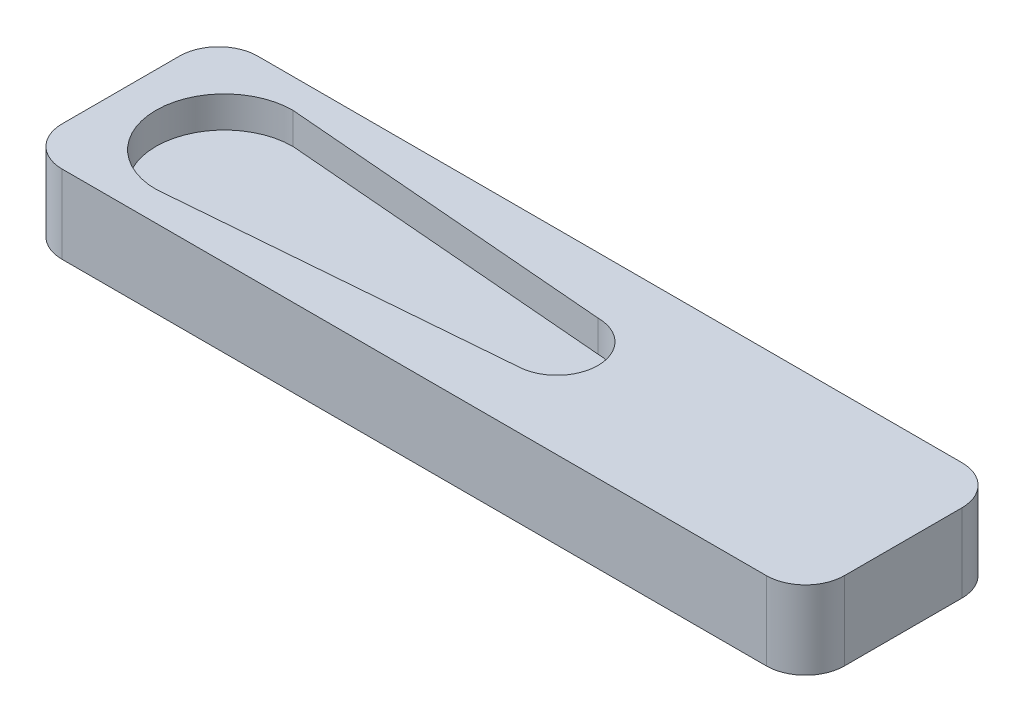
ISO-10303-21;
HEADER;
FILE_DESCRIPTION(('STEP AP214'),'2;1');
FILE_NAME('part.step','',(''),(''),'','','');
FILE_SCHEMA(('AUTOMOTIVE_DESIGN { 1 0 10303 214 1 1 1 1 }'));
ENDSEC;
DATA;
#1=APPLICATION_CONTEXT('core data for automotive mechanical design processes');
#2=APPLICATION_PROTOCOL_DEFINITION('international standard','automotive_design',2000,#1);
#3=PRODUCT_CONTEXT('',#1,'mechanical');
#4=PRODUCT('Part','Part','',(#3));
#5=PRODUCT_RELATED_PRODUCT_CATEGORY('part','',(#4));
#6=PRODUCT_DEFINITION_FORMATION('','',#4);
#7=PRODUCT_DEFINITION_CONTEXT('part definition',#1,'design');
#8=PRODUCT_DEFINITION('design','',#6,#7);
#9=PRODUCT_DEFINITION_SHAPE('','',#8);
#10=(LENGTH_UNIT() NAMED_UNIT(*) SI_UNIT(.MILLI.,.METRE.));
#11=(NAMED_UNIT(*) PLANE_ANGLE_UNIT() SI_UNIT($,.RADIAN.));
#12=(NAMED_UNIT(*) SI_UNIT($,.STERADIAN.) SOLID_ANGLE_UNIT());
#13=UNCERTAINTY_MEASURE_WITH_UNIT(LENGTH_MEASURE(1.E-05),#10,'distance_accuracy_value','');
#14=(GEOMETRIC_REPRESENTATION_CONTEXT(3) GLOBAL_UNCERTAINTY_ASSIGNED_CONTEXT((#13)) GLOBAL_UNIT_ASSIGNED_CONTEXT((#10,
#11,#12)) REPRESENTATION_CONTEXT('',''));
#15=CARTESIAN_POINT('',(0.,0.,0.));
#16=DIRECTION('',(0.,0.,1.));
#17=DIRECTION('',(1.,0.,0.));
#18=AXIS2_PLACEMENT_3D('',#15,#16,#17);
#19=CARTESIAN_POINT('',(20.,4.,5.));
#20=DIRECTION('',(-1.,0.,0.));
#21=DIRECTION('',(0.,0.,1.));
#22=AXIS2_PLACEMENT_3D('',#19,#20,#21);
#23=PLANE('',#22);
#24=DIRECTION('',(0.,0.,-1.));
#25=VECTOR('',#24,1.);
#26=CARTESIAN_POINT('',(20.,4.,5.));
#27=LINE('',#26,#25);
#28=CARTESIAN_POINT('',(20.,4.,3.));
#29=VERTEX_POINT('',#28);
#30=CARTESIAN_POINT('',(20.,4.,-3.));
#31=VERTEX_POINT('',#30);
#32=EDGE_CURVE('E190',#29,#31,#27,.T.);
#33=ORIENTED_EDGE('',*,*,#32,.F.);
#34=DIRECTION('',(0.,-1.,0.));
#35=VECTOR('',#34,1.);
#36=CARTESIAN_POINT('',(20.,4.,3.));
#37=LINE('',#36,#35);
#38=CARTESIAN_POINT('',(20.,0.,3.));
#39=VERTEX_POINT('',#38);
#40=EDGE_CURVE('E221',#29,#39,#37,.T.);
#41=ORIENTED_EDGE('',*,*,#40,.T.);
#42=DIRECTION('',(0.,0.,-1.));
#43=VECTOR('',#42,1.);
#44=CARTESIAN_POINT('',(20.,0.,5.));
#45=LINE('',#44,#43);
#46=CARTESIAN_POINT('',(20.,0.,-3.));
#47=VERTEX_POINT('',#46);
#48=EDGE_CURVE('E184',#39,#47,#45,.T.);
#49=ORIENTED_EDGE('',*,*,#48,.T.);
#50=DIRECTION('',(0.,-1.,0.));
#51=VECTOR('',#50,1.);
#52=CARTESIAN_POINT('',(20.,4.,-3.));
#53=LINE('',#52,#51);
#54=EDGE_CURVE('E205',#47,#31,#53,.F.);
#55=ORIENTED_EDGE('',*,*,#54,.T.);
#56=EDGE_LOOP('',(#33,#41,#49,#55));
#57=FACE_BOUND('',#56,.T.);
#58=ADVANCED_FACE('F45',(#57),#23,.F.);
#59=CARTESIAN_POINT('',(-20.,4.,-5.));
#60=DIRECTION('',(0.,0.,1.));
#61=DIRECTION('',(1.,0.,0.));
#62=AXIS2_PLACEMENT_3D('',#59,#60,#61);
#63=PLANE('',#62);
#64=DIRECTION('',(-1.,0.,0.));
#65=VECTOR('',#64,1.);
#66=CARTESIAN_POINT('',(-20.,4.,-5.));
#67=LINE('',#66,#65);
#68=CARTESIAN_POINT('',(18.,4.,-5.));
#69=VERTEX_POINT('',#68);
#70=CARTESIAN_POINT('',(-18.,4.,-5.));
#71=VERTEX_POINT('',#70);
#72=EDGE_CURVE('E194',#69,#71,#67,.T.);
#73=ORIENTED_EDGE('',*,*,#72,.F.);
#74=DIRECTION('',(0.,-1.,0.));
#75=VECTOR('',#74,1.);
#76=CARTESIAN_POINT('',(18.,4.,-5.));
#77=LINE('',#76,#75);
#78=CARTESIAN_POINT('',(18.,0.,-5.));
#79=VERTEX_POINT('',#78);
#80=EDGE_CURVE('E258',#69,#79,#77,.T.);
#81=ORIENTED_EDGE('',*,*,#80,.T.);
#82=DIRECTION('',(-1.,0.,0.));
#83=VECTOR('',#82,1.);
#84=CARTESIAN_POINT('',(-20.,0.,-5.));
#85=LINE('',#84,#83);
#86=CARTESIAN_POINT('',(-18.,0.,-5.));
#87=VERTEX_POINT('',#86);
#88=EDGE_CURVE('E209',#79,#87,#85,.T.);
#89=ORIENTED_EDGE('',*,*,#88,.T.);
#90=DIRECTION('',(0.,-1.,0.));
#91=VECTOR('',#90,1.);
#92=CARTESIAN_POINT('',(-18.,4.,-5.));
#93=LINE('',#92,#91);
#94=EDGE_CURVE('E255',#87,#71,#93,.F.);
#95=ORIENTED_EDGE('',*,*,#94,.T.);
#96=EDGE_LOOP('',(#73,#81,#89,#95));
#97=FACE_BOUND('',#96,.T.);
#98=ADVANCED_FACE('F294',(#97),#63,.F.);
#99=CARTESIAN_POINT('',(-20.,4.,5.));
#100=DIRECTION('',(1.,0.,0.));
#101=DIRECTION('',(0.,0.,-1.));
#102=AXIS2_PLACEMENT_3D('',#99,#100,#101);
#103=PLANE('',#102);
#104=DIRECTION('',(0.,0.,1.));
#105=VECTOR('',#104,1.);
#106=CARTESIAN_POINT('',(-20.,0.,5.));
#107=LINE('',#106,#105);
#108=CARTESIAN_POINT('',(-20.,0.,-3.));
#109=VERTEX_POINT('',#108);
#110=CARTESIAN_POINT('',(-20.,0.,3.));
#111=VERTEX_POINT('',#110);
#112=EDGE_CURVE('E213',#109,#111,#107,.T.);
#113=ORIENTED_EDGE('',*,*,#112,.T.);
#114=DIRECTION('',(0.,-1.,0.));
#115=VECTOR('',#114,1.);
#116=CARTESIAN_POINT('',(-20.,4.,3.));
#117=LINE('',#116,#115);
#118=CARTESIAN_POINT('',(-20.,4.,3.));
#119=VERTEX_POINT('',#118);
#120=EDGE_CURVE('E11',#111,#119,#117,.F.);
#121=ORIENTED_EDGE('',*,*,#120,.T.);
#122=DIRECTION('',(0.,0.,1.));
#123=VECTOR('',#122,1.);
#124=CARTESIAN_POINT('',(-20.,4.,5.));
#125=LINE('',#124,#123);
#126=CARTESIAN_POINT('',(-20.,4.,-3.));
#127=VERTEX_POINT('',#126);
#128=EDGE_CURVE('E198',#127,#119,#125,.T.);
#129=ORIENTED_EDGE('',*,*,#128,.F.);
#130=DIRECTION('',(0.,-1.,0.));
#131=VECTOR('',#130,1.);
#132=CARTESIAN_POINT('',(-20.,4.,-3.));
#133=LINE('',#132,#131);
#134=EDGE_CURVE('E54',#127,#109,#133,.T.);
#135=ORIENTED_EDGE('',*,*,#134,.T.);
#136=EDGE_LOOP('',(#113,#121,#129,#135));
#137=FACE_BOUND('',#136,.T.);
#138=ADVANCED_FACE('F265',(#137),#103,.F.);
#139=CARTESIAN_POINT('',(-20.,4.,5.));
#140=DIRECTION('',(0.,0.,-1.));
#141=DIRECTION('',(-1.,0.,0.));
#142=AXIS2_PLACEMENT_3D('',#139,#140,#141);
#143=PLANE('',#142);
#144=DIRECTION('',(1.,0.,0.));
#145=VECTOR('',#144,1.);
#146=CARTESIAN_POINT('',(-20.,0.,5.));
#147=LINE('',#146,#145);
#148=CARTESIAN_POINT('',(-18.,0.,5.));
#149=VERTEX_POINT('',#148);
#150=CARTESIAN_POINT('',(18.,0.,5.));
#151=VERTEX_POINT('',#150);
#152=EDGE_CURVE('E195',#149,#151,#147,.T.);
#153=ORIENTED_EDGE('',*,*,#152,.T.);
#154=DIRECTION('',(0.,-1.,0.));
#155=VECTOR('',#154,1.);
#156=CARTESIAN_POINT('',(18.,4.,5.));
#157=LINE('',#156,#155);
#158=CARTESIAN_POINT('',(18.,4.,5.));
#159=VERTEX_POINT('',#158);
#160=EDGE_CURVE('E241',#151,#159,#157,.F.);
#161=ORIENTED_EDGE('',*,*,#160,.T.);
#162=DIRECTION('',(1.,0.,0.));
#163=VECTOR('',#162,1.);
#164=CARTESIAN_POINT('',(-20.,4.,5.));
#165=LINE('',#164,#163);
#166=CARTESIAN_POINT('',(-18.,4.,5.));
#167=VERTEX_POINT('',#166);
#168=EDGE_CURVE('E201',#167,#159,#165,.T.);
#169=ORIENTED_EDGE('',*,*,#168,.F.);
#170=DIRECTION('',(0.,-1.,0.));
#171=VECTOR('',#170,1.);
#172=CARTESIAN_POINT('',(-18.,4.,5.));
#173=LINE('',#172,#171);
#174=EDGE_CURVE('E237',#167,#149,#173,.T.);
#175=ORIENTED_EDGE('',*,*,#174,.T.);
#176=EDGE_LOOP('',(#153,#161,#169,#175));
#177=FACE_BOUND('',#176,.T.);
#178=ADVANCED_FACE('F278',(#177),#143,.F.);
#179=CARTESIAN_POINT('',(0.,4.,0.));
#180=DIRECTION('',(0.,-1.,0.));
#181=DIRECTION('',(0.,0.,-1.));
#182=AXIS2_PLACEMENT_3D('',#179,#180,#181);
#183=PLANE('',#182);
#184=DIRECTION('',(0.996626147989405,0.,-0.0820750945403039));
#185=VECTOR('',#184,1.);
#186=CARTESIAN_POINT('',(-14.7033334206299,4.,3.5));
#187=LINE('',#186,#185);
#188=CARTESIAN_POINT('',(-14.7033334206299,4.,3.5));
#189=VERTEX_POINT('',#188);
#190=CARTESIAN_POINT('',(2.29666657937008,4.,2.1));
#191=VERTEX_POINT('',#190);
#192=EDGE_CURVE('E175',#189,#191,#187,.T.);
#193=ORIENTED_EDGE('',*,*,#192,.F.);
#194=CARTESIAN_POINT('',(-14.7033334206299,4.,0.));
#195=DIRECTION('',(0.,1.,0.));
#196=DIRECTION('',(0.,0.,1.));
#197=AXIS2_PLACEMENT_3D('',#194,#195,#196);
#198=CIRCLE('',#197,3.5);
#199=CARTESIAN_POINT('',(-14.7033334206299,4.,-3.5));
#200=VERTEX_POINT('',#199);
#201=EDGE_CURVE('E142',#200,#189,#198,.T.);
#202=ORIENTED_EDGE('',*,*,#201,.F.);
#203=DIRECTION('',(-0.996626147989405,0.,-0.0820750945403039));
#204=VECTOR('',#203,1.);
#205=CARTESIAN_POINT('',(-14.7033334206299,4.,-3.5));
#206=LINE('',#205,#204);
#207=CARTESIAN_POINT('',(2.29666657937008,4.,-2.1));
#208=VERTEX_POINT('',#207);
#209=EDGE_CURVE('E162',#208,#200,#206,.T.);
#210=ORIENTED_EDGE('',*,*,#209,.F.);
#211=CARTESIAN_POINT('',(2.29666657937008,4.,0.));
#212=DIRECTION('',(0.,1.,0.));
#213=DIRECTION('',(0.,0.,1.));
#214=AXIS2_PLACEMENT_3D('',#211,#212,#213);
#215=CIRCLE('',#214,2.1);
#216=EDGE_CURVE('E166',#191,#208,#215,.T.);
#217=ORIENTED_EDGE('',*,*,#216,.F.);
#218=EDGE_LOOP('',(#193,#202,#210,#217));
#219=FACE_BOUND('',#218,.T.);
#220=ORIENTED_EDGE('',*,*,#168,.T.);
#221=CARTESIAN_POINT('',(18.,4.,3.));
#222=DIRECTION('',(0.,-1.,0.));
#223=DIRECTION('',(0.,0.,-1.));
#224=AXIS2_PLACEMENT_3D('',#221,#222,#223);
#225=CIRCLE('',#224,2.);
#226=EDGE_CURVE('E252',#159,#29,#225,.F.);
#227=ORIENTED_EDGE('',*,*,#226,.T.);
#228=ORIENTED_EDGE('',*,*,#32,.T.);
#229=CARTESIAN_POINT('',(18.,4.,-3.));
#230=DIRECTION('',(0.,-1.,0.));
#231=DIRECTION('',(0.,0.,-1.));
#232=AXIS2_PLACEMENT_3D('',#229,#230,#231);
#233=CIRCLE('',#232,2.);
#234=EDGE_CURVE('E249',#31,#69,#233,.F.);
#235=ORIENTED_EDGE('',*,*,#234,.T.);
#236=ORIENTED_EDGE('',*,*,#72,.T.);
#237=CARTESIAN_POINT('',(-18.,4.,-3.));
#238=DIRECTION('',(0.,-1.,0.));
#239=DIRECTION('',(0.,0.,-1.));
#240=AXIS2_PLACEMENT_3D('',#237,#238,#239);
#241=CIRCLE('',#240,2.);
#242=EDGE_CURVE('E66',#71,#127,#241,.F.);
#243=ORIENTED_EDGE('',*,*,#242,.T.);
#244=ORIENTED_EDGE('',*,*,#128,.T.);
#245=CARTESIAN_POINT('',(-18.,4.,3.));
#246=DIRECTION('',(0.,-1.,0.));
#247=DIRECTION('',(0.,0.,-1.));
#248=AXIS2_PLACEMENT_3D('',#245,#246,#247);
#249=CIRCLE('',#248,2.);
#250=EDGE_CURVE('E246',#119,#167,#249,.F.);
#251=ORIENTED_EDGE('',*,*,#250,.T.);
#252=EDGE_LOOP('',(#220,#227,#228,#235,#236,#243,#244,#251));
#253=FACE_BOUND('',#252,.T.);
#254=ADVANCED_FACE('F281',(#219,#253),#183,.F.);
#255=CARTESIAN_POINT('',(0.,0.,0.));
#256=DIRECTION('',(0.,-1.,0.));
#257=DIRECTION('',(0.,0.,-1.));
#258=AXIS2_PLACEMENT_3D('',#255,#256,#257);
#259=PLANE('',#258);
#260=ORIENTED_EDGE('',*,*,#48,.F.);
#261=CARTESIAN_POINT('',(18.,0.,3.));
#262=DIRECTION('',(0.,-1.,0.));
#263=DIRECTION('',(0.,0.,-1.));
#264=AXIS2_PLACEMENT_3D('',#261,#262,#263);
#265=CIRCLE('',#264,2.);
#266=EDGE_CURVE('E234',#39,#151,#265,.T.);
#267=ORIENTED_EDGE('',*,*,#266,.T.);
#268=ORIENTED_EDGE('',*,*,#152,.F.);
#269=CARTESIAN_POINT('',(-18.,0.,3.));
#270=DIRECTION('',(0.,-1.,0.));
#271=DIRECTION('',(0.,0.,-1.));
#272=AXIS2_PLACEMENT_3D('',#269,#270,#271);
#273=CIRCLE('',#272,2.);
#274=EDGE_CURVE('E228',#149,#111,#273,.T.);
#275=ORIENTED_EDGE('',*,*,#274,.T.);
#276=ORIENTED_EDGE('',*,*,#112,.F.);
#277=CARTESIAN_POINT('',(-18.,0.,-3.));
#278=DIRECTION('',(0.,-1.,0.));
#279=DIRECTION('',(0.,0.,-1.));
#280=AXIS2_PLACEMENT_3D('',#277,#278,#279);
#281=CIRCLE('',#280,2.);
#282=EDGE_CURVE('E225',#109,#87,#281,.T.);
#283=ORIENTED_EDGE('',*,*,#282,.T.);
#284=ORIENTED_EDGE('',*,*,#88,.F.);
#285=CARTESIAN_POINT('',(18.,0.,-3.));
#286=DIRECTION('',(0.,-1.,0.));
#287=DIRECTION('',(0.,0.,-1.));
#288=AXIS2_PLACEMENT_3D('',#285,#286,#287);
#289=CIRCLE('',#288,2.);
#290=EDGE_CURVE('E231',#79,#47,#289,.T.);
#291=ORIENTED_EDGE('',*,*,#290,.T.);
#292=EDGE_LOOP('',(#260,#267,#268,#275,#276,#283,#284,#291));
#293=FACE_BOUND('',#292,.T.);
#294=ADVANCED_FACE('F269',(#293),#259,.T.);
#295=CARTESIAN_POINT('',(-14.7033334206299,2.4,0.));
#296=DIRECTION('',(0.,1.,0.));
#297=DIRECTION('',(0.,0.,1.));
#298=AXIS2_PLACEMENT_3D('',#295,#296,#297);
#299=CYLINDRICAL_SURFACE('',#298,3.5);
#300=ORIENTED_EDGE('',*,*,#201,.T.);
#301=DIRECTION('',(0.,1.,0.));
#302=VECTOR('',#301,1.);
#303=CARTESIAN_POINT('',(-14.7033334206299,2.4,3.5));
#304=LINE('',#303,#302);
#305=CARTESIAN_POINT('',(-14.7033334206299,2.4,3.5));
#306=VERTEX_POINT('',#305);
#307=EDGE_CURVE('E135',#306,#189,#304,.T.);
#308=ORIENTED_EDGE('',*,*,#307,.F.);
#309=CARTESIAN_POINT('',(-14.7033334206299,2.4,0.));
#310=DIRECTION('',(0.,1.,0.));
#311=DIRECTION('',(0.,0.,1.));
#312=AXIS2_PLACEMENT_3D('',#309,#310,#311);
#313=CIRCLE('',#312,3.5);
#314=CARTESIAN_POINT('',(-14.7033334206299,2.4,-3.5));
#315=VERTEX_POINT('',#314);
#316=EDGE_CURVE('E139',#315,#306,#313,.T.);
#317=ORIENTED_EDGE('',*,*,#316,.F.);
#318=DIRECTION('',(0.,1.,0.));
#319=VECTOR('',#318,1.);
#320=CARTESIAN_POINT('',(-14.7033334206299,2.4,-3.5));
#321=LINE('',#320,#319);
#322=EDGE_CURVE('E181',#315,#200,#321,.T.);
#323=ORIENTED_EDGE('',*,*,#322,.T.);
#324=EDGE_LOOP('',(#300,#308,#317,#323));
#325=FACE_BOUND('',#324,.T.);
#326=ADVANCED_FACE('F137',(#325),#299,.F.);
#327=CARTESIAN_POINT('',(-14.7033334206299,2.4,-3.5));
#328=DIRECTION('',(0.0820750945403039,0.,-0.996626147989405));
#329=DIRECTION('',(-0.996626147989405,0.,-0.0820750945403039));
#330=AXIS2_PLACEMENT_3D('',#327,#328,#329);
#331=PLANE('',#330);
#332=ORIENTED_EDGE('',*,*,#209,.T.);
#333=ORIENTED_EDGE('',*,*,#322,.F.);
#334=DIRECTION('',(-0.996626147989405,0.,-0.0820750945403039));
#335=VECTOR('',#334,1.);
#336=CARTESIAN_POINT('',(-14.7033334206299,2.4,-3.5));
#337=LINE('',#336,#335);
#338=CARTESIAN_POINT('',(2.29666657937008,2.4,-2.1));
#339=VERTEX_POINT('',#338);
#340=EDGE_CURVE('E148',#339,#315,#337,.T.);
#341=ORIENTED_EDGE('',*,*,#340,.F.);
#342=DIRECTION('',(0.,1.,0.));
#343=VECTOR('',#342,1.);
#344=CARTESIAN_POINT('',(2.29666657937008,2.4,-2.1));
#345=LINE('',#344,#343);
#346=EDGE_CURVE('E185',#339,#208,#345,.T.);
#347=ORIENTED_EDGE('',*,*,#346,.T.);
#348=EDGE_LOOP('',(#332,#333,#341,#347));
#349=FACE_BOUND('',#348,.T.);
#350=ADVANCED_FACE('F354',(#349),#331,.F.);
#351=CARTESIAN_POINT('',(2.29666657937008,2.4,0.));
#352=DIRECTION('',(0.,1.,0.));
#353=DIRECTION('',(0.,0.,1.));
#354=AXIS2_PLACEMENT_3D('',#351,#352,#353);
#355=CYLINDRICAL_SURFACE('',#354,2.1);
#356=ORIENTED_EDGE('',*,*,#216,.T.);
#357=ORIENTED_EDGE('',*,*,#346,.F.);
#358=CARTESIAN_POINT('',(2.29666657937008,2.4,0.));
#359=DIRECTION('',(0.,1.,0.));
#360=DIRECTION('',(0.,0.,1.));
#361=AXIS2_PLACEMENT_3D('',#358,#359,#360);
#362=CIRCLE('',#361,2.1);
#363=CARTESIAN_POINT('',(2.29666657937008,2.4,2.1));
#364=VERTEX_POINT('',#363);
#365=EDGE_CURVE('E157',#364,#339,#362,.T.);
#366=ORIENTED_EDGE('',*,*,#365,.F.);
#367=DIRECTION('',(0.,1.,0.));
#368=VECTOR('',#367,1.);
#369=CARTESIAN_POINT('',(2.29666657937008,2.4,2.1));
#370=LINE('',#369,#368);
#371=EDGE_CURVE('E147',#364,#191,#370,.T.);
#372=ORIENTED_EDGE('',*,*,#371,.T.);
#373=EDGE_LOOP('',(#356,#357,#366,#372));
#374=FACE_BOUND('',#373,.T.);
#375=ADVANCED_FACE('F346',(#374),#355,.F.);
#376=CARTESIAN_POINT('',(-14.7033334206299,2.4,3.5));
#377=DIRECTION('',(0.0820750945403039,0.,0.996626147989405));
#378=DIRECTION('',(0.996626147989405,0.,-0.0820750945403039));
#379=AXIS2_PLACEMENT_3D('',#376,#377,#378);
#380=PLANE('',#379);
#381=ORIENTED_EDGE('',*,*,#192,.T.);
#382=ORIENTED_EDGE('',*,*,#371,.F.);
#383=DIRECTION('',(0.996626147989405,0.,-0.0820750945403039));
#384=VECTOR('',#383,1.);
#385=CARTESIAN_POINT('',(-14.7033334206299,2.4,3.5));
#386=LINE('',#385,#384);
#387=EDGE_CURVE('E151',#306,#364,#386,.T.);
#388=ORIENTED_EDGE('',*,*,#387,.F.);
#389=ORIENTED_EDGE('',*,*,#307,.T.);
#390=EDGE_LOOP('',(#381,#382,#388,#389));
#391=FACE_BOUND('',#390,.T.);
#392=ADVANCED_FACE('F152',(#391),#380,.F.);
#393=CARTESIAN_POINT('',(-14.7033334206299,2.4,0.));
#394=DIRECTION('',(0.,1.,0.));
#395=DIRECTION('',(0.,0.,1.));
#396=AXIS2_PLACEMENT_3D('',#393,#394,#395);
#397=PLANE('',#396);
#398=ORIENTED_EDGE('',*,*,#316,.T.);
#399=ORIENTED_EDGE('',*,*,#387,.T.);
#400=ORIENTED_EDGE('',*,*,#365,.T.);
#401=ORIENTED_EDGE('',*,*,#340,.T.);
#402=EDGE_LOOP('',(#398,#399,#400,#401));
#403=FACE_BOUND('',#402,.T.);
#404=ADVANCED_FACE('F159',(#403),#397,.T.);
#405=CARTESIAN_POINT('',(18.,4.,3.));
#406=DIRECTION('',(0.,-1.,0.));
#407=DIRECTION('',(0.,0.,-1.));
#408=AXIS2_PLACEMENT_3D('',#405,#406,#407);
#409=CYLINDRICAL_SURFACE('',#408,2.);
#410=ORIENTED_EDGE('',*,*,#226,.F.);
#411=ORIENTED_EDGE('',*,*,#160,.F.);
#412=ORIENTED_EDGE('',*,*,#266,.F.);
#413=ORIENTED_EDGE('',*,*,#40,.F.);
#414=EDGE_LOOP('',(#410,#411,#412,#413));
#415=FACE_BOUND('',#414,.T.);
#416=ADVANCED_FACE('F285',(#415),#409,.T.);
#417=CARTESIAN_POINT('',(18.,4.,-3.));
#418=DIRECTION('',(0.,-1.,0.));
#419=DIRECTION('',(0.,0.,-1.));
#420=AXIS2_PLACEMENT_3D('',#417,#418,#419);
#421=CYLINDRICAL_SURFACE('',#420,2.);
#422=ORIENTED_EDGE('',*,*,#234,.F.);
#423=ORIENTED_EDGE('',*,*,#54,.F.);
#424=ORIENTED_EDGE('',*,*,#290,.F.);
#425=ORIENTED_EDGE('',*,*,#80,.F.);
#426=EDGE_LOOP('',(#422,#423,#424,#425));
#427=FACE_BOUND('',#426,.T.);
#428=ADVANCED_FACE('F291',(#427),#421,.T.);
#429=CARTESIAN_POINT('',(-18.,4.,3.));
#430=DIRECTION('',(0.,-1.,0.));
#431=DIRECTION('',(0.,0.,-1.));
#432=AXIS2_PLACEMENT_3D('',#429,#430,#431);
#433=CYLINDRICAL_SURFACE('',#432,2.);
#434=ORIENTED_EDGE('',*,*,#250,.F.);
#435=ORIENTED_EDGE('',*,*,#120,.F.);
#436=ORIENTED_EDGE('',*,*,#274,.F.);
#437=ORIENTED_EDGE('',*,*,#174,.F.);
#438=EDGE_LOOP('',(#434,#435,#436,#437));
#439=FACE_BOUND('',#438,.T.);
#440=ADVANCED_FACE('F275',(#439),#433,.T.);
#441=CARTESIAN_POINT('',(-18.,4.,-3.));
#442=DIRECTION('',(0.,-1.,0.));
#443=DIRECTION('',(0.,0.,-1.));
#444=AXIS2_PLACEMENT_3D('',#441,#442,#443);
#445=CYLINDRICAL_SURFACE('',#444,2.);
#446=ORIENTED_EDGE('',*,*,#242,.F.);
#447=ORIENTED_EDGE('',*,*,#94,.F.);
#448=ORIENTED_EDGE('',*,*,#282,.F.);
#449=ORIENTED_EDGE('',*,*,#134,.F.);
#450=EDGE_LOOP('',(#446,#447,#448,#449));
#451=FACE_BOUND('',#450,.T.);
#452=ADVANCED_FACE('F47',(#451),#445,.T.);
#453=CLOSED_SHELL('',(#58,#98,#138,#178,#254,#294,#326,#350,#375,#392,#404,#416,#428,#440,#452));
#454=MANIFOLD_SOLID_BREP('B2',#453);
#455=ADVANCED_BREP_SHAPE_REPRESENTATION('',(#18,#454),#14);
#456=SHAPE_DEFINITION_REPRESENTATION(#9,#455);
ENDSEC;
END-ISO-10303-21;
